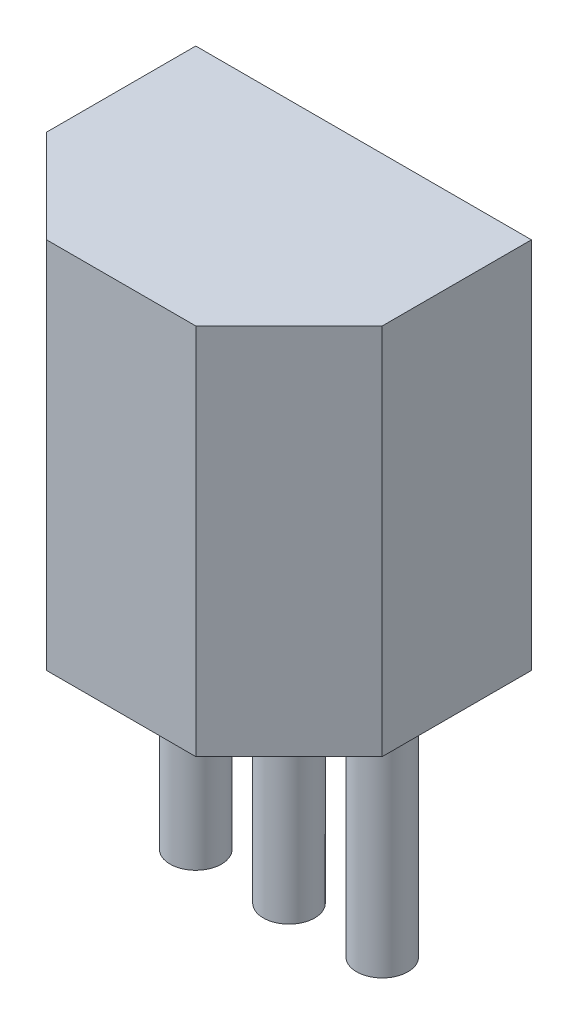
ISO-10303-21;
HEADER;
FILE_DESCRIPTION(('STEP AP214'),'2;1');
FILE_NAME('part.step','',(''),(''),'','','');
FILE_SCHEMA(('AUTOMOTIVE_DESIGN { 1 0 10303 214 1 1 1 1 }'));
ENDSEC;
DATA;
#1=APPLICATION_CONTEXT('core data for automotive mechanical design processes');
#2=APPLICATION_PROTOCOL_DEFINITION('international standard','automotive_design',2000,#1);
#3=PRODUCT_CONTEXT('',#1,'mechanical');
#4=PRODUCT('Part','Part','',(#3));
#5=PRODUCT_RELATED_PRODUCT_CATEGORY('part','',(#4));
#6=PRODUCT_DEFINITION_FORMATION('','',#4);
#7=PRODUCT_DEFINITION_CONTEXT('part definition',#1,'design');
#8=PRODUCT_DEFINITION('design','',#6,#7);
#9=PRODUCT_DEFINITION_SHAPE('','',#8);
#10=(LENGTH_UNIT() NAMED_UNIT(*) SI_UNIT(.MILLI.,.METRE.));
#11=(NAMED_UNIT(*) PLANE_ANGLE_UNIT() SI_UNIT($,.RADIAN.));
#12=(NAMED_UNIT(*) SI_UNIT($,.STERADIAN.) SOLID_ANGLE_UNIT());
#13=UNCERTAINTY_MEASURE_WITH_UNIT(LENGTH_MEASURE(1.E-05),#10,'distance_accuracy_value','');
#14=(GEOMETRIC_REPRESENTATION_CONTEXT(3) GLOBAL_UNCERTAINTY_ASSIGNED_CONTEXT((#13)) GLOBAL_UNIT_ASSIGNED_CONTEXT((#10,
#11,#12)) REPRESENTATION_CONTEXT('',''));
#15=CARTESIAN_POINT('',(0.,0.,0.));
#16=DIRECTION('',(0.,0.,1.));
#17=DIRECTION('',(1.,0.,0.));
#18=AXIS2_PLACEMENT_3D('',#15,#16,#17);
#19=CARTESIAN_POINT('',(-1.016,0.,-1.016));
#20=DIRECTION('',(0.,-1.,0.));
#21=DIRECTION('',(0.,0.,-1.));
#22=AXIS2_PLACEMENT_3D('',#19,#20,#21);
#23=PLANE('',#22);
#24=CARTESIAN_POINT('',(1.27,0.,0.));
#25=DIRECTION('',(0.,-1.,0.));
#26=DIRECTION('',(0.,0.,-1.));
#27=AXIS2_PLACEMENT_3D('',#24,#25,#26);
#28=CIRCLE('',#27,0.35);
#29=CARTESIAN_POINT('',(1.27,0.,-0.35));
#30=VERTEX_POINT('',#29);
#31=EDGE_CURVE('E188',#30,#30,#28,.T.);
#32=ORIENTED_EDGE('',*,*,#31,.F.);
#33=EDGE_LOOP('',(#32));
#34=FACE_BOUND('',#33,.T.);
#35=DIRECTION('',(0.,0.,1.));
#36=VECTOR('',#35,1.);
#37=CARTESIAN_POINT('',(-1.016,0.,1.016));
#38=LINE('',#37,#36);
#39=CARTESIAN_POINT('',(-1.016,0.,-1.016));
#40=VERTEX_POINT('',#39);
#41=CARTESIAN_POINT('',(-1.016,0.,1.016));
#42=VERTEX_POINT('',#41);
#43=EDGE_CURVE('E118',#40,#42,#38,.T.);
#44=ORIENTED_EDGE('',*,*,#43,.F.);
#45=DIRECTION('',(-1.,0.,0.));
#46=VECTOR('',#45,1.);
#47=CARTESIAN_POINT('',(-1.016,0.,-1.016));
#48=LINE('',#47,#46);
#49=CARTESIAN_POINT('',(3.556,0.,-1.016));
#50=VERTEX_POINT('',#49);
#51=EDGE_CURVE('E79',#50,#40,#48,.T.);
#52=ORIENTED_EDGE('',*,*,#51,.F.);
#53=DIRECTION('',(0.,0.,-1.));
#54=VECTOR('',#53,1.);
#55=CARTESIAN_POINT('',(3.556,0.,1.016));
#56=LINE('',#55,#54);
#57=CARTESIAN_POINT('',(3.556,0.,1.016));
#58=VERTEX_POINT('',#57);
#59=EDGE_CURVE('E73',#58,#50,#56,.T.);
#60=ORIENTED_EDGE('',*,*,#59,.F.);
#61=DIRECTION('',(0.707106781186547,0.,-0.707106781186547));
#62=VECTOR('',#61,1.);
#63=CARTESIAN_POINT('',(2.286,0.,2.286));
#64=LINE('',#63,#62);
#65=CARTESIAN_POINT('',(2.286,0.,2.286));
#66=VERTEX_POINT('',#65);
#67=EDGE_CURVE('E108',#66,#58,#64,.T.);
#68=ORIENTED_EDGE('',*,*,#67,.F.);
#69=DIRECTION('',(1.,0.,0.));
#70=VECTOR('',#69,1.);
#71=CARTESIAN_POINT('',(0.254,0.,2.286));
#72=LINE('',#71,#70);
#73=CARTESIAN_POINT('',(0.254,0.,2.286));
#74=VERTEX_POINT('',#73);
#75=EDGE_CURVE('E124',#74,#66,#72,.T.);
#76=ORIENTED_EDGE('',*,*,#75,.F.);
#77=DIRECTION('',(0.707106781186547,0.,0.707106781186547));
#78=VECTOR('',#77,1.);
#79=CARTESIAN_POINT('',(-1.016,0.,1.016));
#80=LINE('',#79,#78);
#81=EDGE_CURVE('E121',#42,#74,#80,.T.);
#82=ORIENTED_EDGE('',*,*,#81,.F.);
#83=EDGE_LOOP('',(#44,#52,#60,#68,#76,#82));
#84=FACE_BOUND('',#83,.T.);
#85=CARTESIAN_POINT('',(0.,0.,0.));
#86=DIRECTION('',(0.,-1.,0.));
#87=DIRECTION('',(0.,0.,-1.));
#88=AXIS2_PLACEMENT_3D('',#85,#86,#87);
#89=CIRCLE('',#88,0.35);
#90=CARTESIAN_POINT('',(0.,0.,-0.35));
#91=VERTEX_POINT('',#90);
#92=EDGE_CURVE('E198',#91,#91,#89,.T.);
#93=ORIENTED_EDGE('',*,*,#92,.F.);
#94=EDGE_LOOP('',(#93));
#95=FACE_BOUND('',#94,.T.);
#96=CARTESIAN_POINT('',(2.54,0.,0.));
#97=DIRECTION('',(0.,-1.,0.));
#98=DIRECTION('',(0.,0.,-1.));
#99=AXIS2_PLACEMENT_3D('',#96,#97,#98);
#100=CIRCLE('',#99,0.35);
#101=CARTESIAN_POINT('',(2.54,0.,-0.35));
#102=VERTEX_POINT('',#101);
#103=EDGE_CURVE('E189',#102,#102,#100,.T.);
#104=ORIENTED_EDGE('',*,*,#103,.F.);
#105=EDGE_LOOP('',(#104));
#106=FACE_BOUND('',#105,.T.);
#107=ADVANCED_FACE('F33',(#34,#84,#95,#106),#23,.T.);
#108=CARTESIAN_POINT('',(-1.016,5.08,1.016));
#109=DIRECTION('',(1.,0.,0.));
#110=DIRECTION('',(0.,0.,-1.));
#111=AXIS2_PLACEMENT_3D('',#108,#109,#110);
#112=PLANE('',#111);
#113=ORIENTED_EDGE('',*,*,#43,.T.);
#114=DIRECTION('',(0.,-1.,0.));
#115=VECTOR('',#114,1.);
#116=CARTESIAN_POINT('',(-1.016,5.08,1.016));
#117=LINE('',#116,#115);
#118=CARTESIAN_POINT('',(-1.016,5.08,1.016));
#119=VERTEX_POINT('',#118);
#120=EDGE_CURVE('E11',#119,#42,#117,.T.);
#121=ORIENTED_EDGE('',*,*,#120,.F.);
#122=DIRECTION('',(0.,0.,1.));
#123=VECTOR('',#122,1.);
#124=CARTESIAN_POINT('',(-1.016,5.08,1.016));
#125=LINE('',#124,#123);
#126=CARTESIAN_POINT('',(-1.016,5.08,-1.016));
#127=VERTEX_POINT('',#126);
#128=EDGE_CURVE('E129',#127,#119,#125,.T.);
#129=ORIENTED_EDGE('',*,*,#128,.F.);
#130=DIRECTION('',(0.,-1.,0.));
#131=VECTOR('',#130,1.);
#132=CARTESIAN_POINT('',(-1.016,5.08,-1.016));
#133=LINE('',#132,#131);
#134=EDGE_CURVE('E114',#127,#40,#133,.T.);
#135=ORIENTED_EDGE('',*,*,#134,.T.);
#136=EDGE_LOOP('',(#113,#121,#129,#135));
#137=FACE_BOUND('',#136,.T.);
#138=ADVANCED_FACE('F35',(#137),#112,.F.);
#139=CARTESIAN_POINT('',(-1.016,5.08,1.016));
#140=DIRECTION('',(0.707106781186548,0.,-0.707106781186548));
#141=DIRECTION('',(-0.707106781186548,0.,-0.707106781186548));
#142=AXIS2_PLACEMENT_3D('',#139,#140,#141);
#143=PLANE('',#142);
#144=ORIENTED_EDGE('',*,*,#81,.T.);
#145=DIRECTION('',(0.,-1.,0.));
#146=VECTOR('',#145,1.);
#147=CARTESIAN_POINT('',(0.254,5.08,2.286));
#148=LINE('',#147,#146);
#149=CARTESIAN_POINT('',(0.254,5.08,2.286));
#150=VERTEX_POINT('',#149);
#151=EDGE_CURVE('E42',#150,#74,#148,.T.);
#152=ORIENTED_EDGE('',*,*,#151,.F.);
#153=DIRECTION('',(0.707106781186547,0.,0.707106781186547));
#154=VECTOR('',#153,1.);
#155=CARTESIAN_POINT('',(-1.016,5.08,1.016));
#156=LINE('',#155,#154);
#157=EDGE_CURVE('E87',#119,#150,#156,.T.);
#158=ORIENTED_EDGE('',*,*,#157,.F.);
#159=ORIENTED_EDGE('',*,*,#120,.T.);
#160=EDGE_LOOP('',(#144,#152,#158,#159));
#161=FACE_BOUND('',#160,.T.);
#162=ADVANCED_FACE('F158',(#161),#143,.F.);
#163=CARTESIAN_POINT('',(0.254,5.08,2.286));
#164=DIRECTION('',(0.,0.,-1.));
#165=DIRECTION('',(-1.,0.,0.));
#166=AXIS2_PLACEMENT_3D('',#163,#164,#165);
#167=PLANE('',#166);
#168=ORIENTED_EDGE('',*,*,#75,.T.);
#169=DIRECTION('',(0.,-1.,0.));
#170=VECTOR('',#169,1.);
#171=CARTESIAN_POINT('',(2.286,5.08,2.286));
#172=LINE('',#171,#170);
#173=CARTESIAN_POINT('',(2.286,5.08,2.286));
#174=VERTEX_POINT('',#173);
#175=EDGE_CURVE('E109',#174,#66,#172,.T.);
#176=ORIENTED_EDGE('',*,*,#175,.F.);
#177=DIRECTION('',(1.,0.,0.));
#178=VECTOR('',#177,1.);
#179=CARTESIAN_POINT('',(0.254,5.08,2.286));
#180=LINE('',#179,#178);
#181=EDGE_CURVE('E100',#150,#174,#180,.T.);
#182=ORIENTED_EDGE('',*,*,#181,.F.);
#183=ORIENTED_EDGE('',*,*,#151,.T.);
#184=EDGE_LOOP('',(#168,#176,#182,#183));
#185=FACE_BOUND('',#184,.T.);
#186=ADVANCED_FACE('F135',(#185),#167,.F.);
#187=CARTESIAN_POINT('',(2.286,5.08,2.286));
#188=DIRECTION('',(-0.707106781186548,0.,-0.707106781186548));
#189=DIRECTION('',(-0.707106781186548,0.,0.707106781186548));
#190=AXIS2_PLACEMENT_3D('',#187,#188,#189);
#191=PLANE('',#190);
#192=ORIENTED_EDGE('',*,*,#67,.T.);
#193=DIRECTION('',(0.,-1.,0.));
#194=VECTOR('',#193,1.);
#195=CARTESIAN_POINT('',(3.556,5.08,1.016));
#196=LINE('',#195,#194);
#197=CARTESIAN_POINT('',(3.556,5.08,1.016));
#198=VERTEX_POINT('',#197);
#199=EDGE_CURVE('E105',#198,#58,#196,.T.);
#200=ORIENTED_EDGE('',*,*,#199,.F.);
#201=DIRECTION('',(0.707106781186547,0.,-0.707106781186547));
#202=VECTOR('',#201,1.);
#203=CARTESIAN_POINT('',(2.286,5.08,2.286));
#204=LINE('',#203,#202);
#205=EDGE_CURVE('E94',#174,#198,#204,.T.);
#206=ORIENTED_EDGE('',*,*,#205,.F.);
#207=ORIENTED_EDGE('',*,*,#175,.T.);
#208=EDGE_LOOP('',(#192,#200,#206,#207));
#209=FACE_BOUND('',#208,.T.);
#210=ADVANCED_FACE('F106',(#209),#191,.F.);
#211=CARTESIAN_POINT('',(3.556,5.08,1.016));
#212=DIRECTION('',(-1.,0.,0.));
#213=DIRECTION('',(0.,0.,1.));
#214=AXIS2_PLACEMENT_3D('',#211,#212,#213);
#215=PLANE('',#214);
#216=ORIENTED_EDGE('',*,*,#59,.T.);
#217=DIRECTION('',(0.,-1.,0.));
#218=VECTOR('',#217,1.);
#219=CARTESIAN_POINT('',(3.556,5.08,-1.016));
#220=LINE('',#219,#218);
#221=CARTESIAN_POINT('',(3.556,5.08,-1.016));
#222=VERTEX_POINT('',#221);
#223=EDGE_CURVE('E110',#222,#50,#220,.T.);
#224=ORIENTED_EDGE('',*,*,#223,.F.);
#225=DIRECTION('',(0.,0.,-1.));
#226=VECTOR('',#225,1.);
#227=CARTESIAN_POINT('',(3.556,5.08,1.016));
#228=LINE('',#227,#226);
#229=EDGE_CURVE('E98',#198,#222,#228,.T.);
#230=ORIENTED_EDGE('',*,*,#229,.F.);
#231=ORIENTED_EDGE('',*,*,#199,.T.);
#232=EDGE_LOOP('',(#216,#224,#230,#231));
#233=FACE_BOUND('',#232,.T.);
#234=ADVANCED_FACE('F112',(#233),#215,.F.);
#235=CARTESIAN_POINT('',(-1.016,5.08,-1.016));
#236=DIRECTION('',(0.,0.,1.));
#237=DIRECTION('',(1.,0.,0.));
#238=AXIS2_PLACEMENT_3D('',#235,#236,#237);
#239=PLANE('',#238);
#240=ORIENTED_EDGE('',*,*,#51,.T.);
#241=ORIENTED_EDGE('',*,*,#134,.F.);
#242=DIRECTION('',(-1.,0.,0.));
#243=VECTOR('',#242,1.);
#244=CARTESIAN_POINT('',(-1.016,5.08,-1.016));
#245=LINE('',#244,#243);
#246=EDGE_CURVE('E50',#222,#127,#245,.T.);
#247=ORIENTED_EDGE('',*,*,#246,.F.);
#248=ORIENTED_EDGE('',*,*,#223,.T.);
#249=EDGE_LOOP('',(#240,#241,#247,#248));
#250=FACE_BOUND('',#249,.T.);
#251=ADVANCED_FACE('F142',(#250),#239,.F.);
#252=CARTESIAN_POINT('',(-1.016,5.08,-1.016));
#253=DIRECTION('',(0.,-1.,0.));
#254=DIRECTION('',(0.,0.,-1.));
#255=AXIS2_PLACEMENT_3D('',#252,#253,#254);
#256=PLANE('',#255);
#257=ORIENTED_EDGE('',*,*,#128,.T.);
#258=ORIENTED_EDGE('',*,*,#157,.T.);
#259=ORIENTED_EDGE('',*,*,#181,.T.);
#260=ORIENTED_EDGE('',*,*,#205,.T.);
#261=ORIENTED_EDGE('',*,*,#229,.T.);
#262=ORIENTED_EDGE('',*,*,#246,.T.);
#263=EDGE_LOOP('',(#257,#258,#259,#260,#261,#262));
#264=FACE_BOUND('',#263,.T.);
#265=ADVANCED_FACE('F96',(#264),#256,.F.);
#266=CARTESIAN_POINT('',(0.,-3.38,0.));
#267=DIRECTION('',(0.,1.,0.));
#268=DIRECTION('',(0.,0.,1.));
#269=AXIS2_PLACEMENT_3D('',#266,#267,#268);
#270=CYLINDRICAL_SURFACE('',#269,0.35);
#271=CARTESIAN_POINT('',(0.,-3.38,0.));
#272=DIRECTION('',(0.,-1.,0.));
#273=DIRECTION('',(0.,0.,-1.));
#274=AXIS2_PLACEMENT_3D('',#271,#272,#273);
#275=CIRCLE('',#274,0.35);
#276=CARTESIAN_POINT('',(0.,-3.38,-0.35));
#277=VERTEX_POINT('',#276);
#278=EDGE_CURVE('E122',#277,#277,#275,.T.);
#279=ORIENTED_EDGE('',*,*,#278,.F.);
#280=EDGE_LOOP('',(#279));
#281=FACE_BOUND('',#280,.T.);
#282=ORIENTED_EDGE('',*,*,#92,.T.);
#283=EDGE_LOOP('',(#282));
#284=FACE_BOUND('',#283,.T.);
#285=ADVANCED_FACE('F149',(#281,#284),#270,.T.);
#286=CARTESIAN_POINT('',(0.,-3.38,0.));
#287=DIRECTION('',(0.,-1.,0.));
#288=DIRECTION('',(0.,0.,-1.));
#289=AXIS2_PLACEMENT_3D('',#286,#287,#288);
#290=PLANE('',#289);
#291=ORIENTED_EDGE('',*,*,#278,.T.);
#292=EDGE_LOOP('',(#291));
#293=FACE_BOUND('',#292,.T.);
#294=ADVANCED_FACE('F163',(#293),#290,.T.);
#295=CARTESIAN_POINT('',(1.27,-3.38,0.));
#296=DIRECTION('',(0.,1.,0.));
#297=DIRECTION('',(0.,0.,1.));
#298=AXIS2_PLACEMENT_3D('',#295,#296,#297);
#299=CYLINDRICAL_SURFACE('',#298,0.35);
#300=CARTESIAN_POINT('',(1.27,-3.38,0.));
#301=DIRECTION('',(0.,-1.,0.));
#302=DIRECTION('',(0.,0.,-1.));
#303=AXIS2_PLACEMENT_3D('',#300,#301,#302);
#304=CIRCLE('',#303,0.35);
#305=CARTESIAN_POINT('',(1.27,-3.38,-0.35));
#306=VERTEX_POINT('',#305);
#307=EDGE_CURVE('E192',#306,#306,#304,.T.);
#308=ORIENTED_EDGE('',*,*,#307,.F.);
#309=EDGE_LOOP('',(#308));
#310=FACE_BOUND('',#309,.T.);
#311=ORIENTED_EDGE('',*,*,#31,.T.);
#312=EDGE_LOOP('',(#311));
#313=FACE_BOUND('',#312,.T.);
#314=ADVANCED_FACE('F167',(#310,#313),#299,.T.);
#315=CARTESIAN_POINT('',(1.27,-3.38,0.));
#316=DIRECTION('',(0.,-1.,0.));
#317=DIRECTION('',(0.,0.,-1.));
#318=AXIS2_PLACEMENT_3D('',#315,#316,#317);
#319=PLANE('',#318);
#320=ORIENTED_EDGE('',*,*,#307,.T.);
#321=EDGE_LOOP('',(#320));
#322=FACE_BOUND('',#321,.T.);
#323=ADVANCED_FACE('F171',(#322),#319,.T.);
#324=CARTESIAN_POINT('',(2.54,-3.38,0.));
#325=DIRECTION('',(0.,1.,0.));
#326=DIRECTION('',(0.,0.,1.));
#327=AXIS2_PLACEMENT_3D('',#324,#325,#326);
#328=CYLINDRICAL_SURFACE('',#327,0.35);
#329=CARTESIAN_POINT('',(2.54,-3.38,0.));
#330=DIRECTION('',(0.,-1.,0.));
#331=DIRECTION('',(0.,0.,-1.));
#332=AXIS2_PLACEMENT_3D('',#329,#330,#331);
#333=CIRCLE('',#332,0.35);
#334=CARTESIAN_POINT('',(2.54,-3.38,-0.35));
#335=VERTEX_POINT('',#334);
#336=EDGE_CURVE('E187',#335,#335,#333,.T.);
#337=ORIENTED_EDGE('',*,*,#336,.F.);
#338=EDGE_LOOP('',(#337));
#339=FACE_BOUND('',#338,.T.);
#340=ORIENTED_EDGE('',*,*,#103,.T.);
#341=EDGE_LOOP('',(#340));
#342=FACE_BOUND('',#341,.T.);
#343=ADVANCED_FACE('F175',(#339,#342),#328,.T.);
#344=CARTESIAN_POINT('',(2.54,-3.38,0.));
#345=DIRECTION('',(0.,-1.,0.));
#346=DIRECTION('',(0.,0.,-1.));
#347=AXIS2_PLACEMENT_3D('',#344,#345,#346);
#348=PLANE('',#347);
#349=ORIENTED_EDGE('',*,*,#336,.T.);
#350=EDGE_LOOP('',(#349));
#351=FACE_BOUND('',#350,.T.);
#352=ADVANCED_FACE('F179',(#351),#348,.T.);
#353=CLOSED_SHELL('',(#107,#138,#162,#186,#210,#234,#251,#265,#285,#294,#314,#323,#343,#352));
#354=MANIFOLD_SOLID_BREP('B2',#353);
#355=ADVANCED_BREP_SHAPE_REPRESENTATION('',(#18,#354),#14);
#356=SHAPE_DEFINITION_REPRESENTATION(#9,#355);
ENDSEC;
END-ISO-10303-21;
